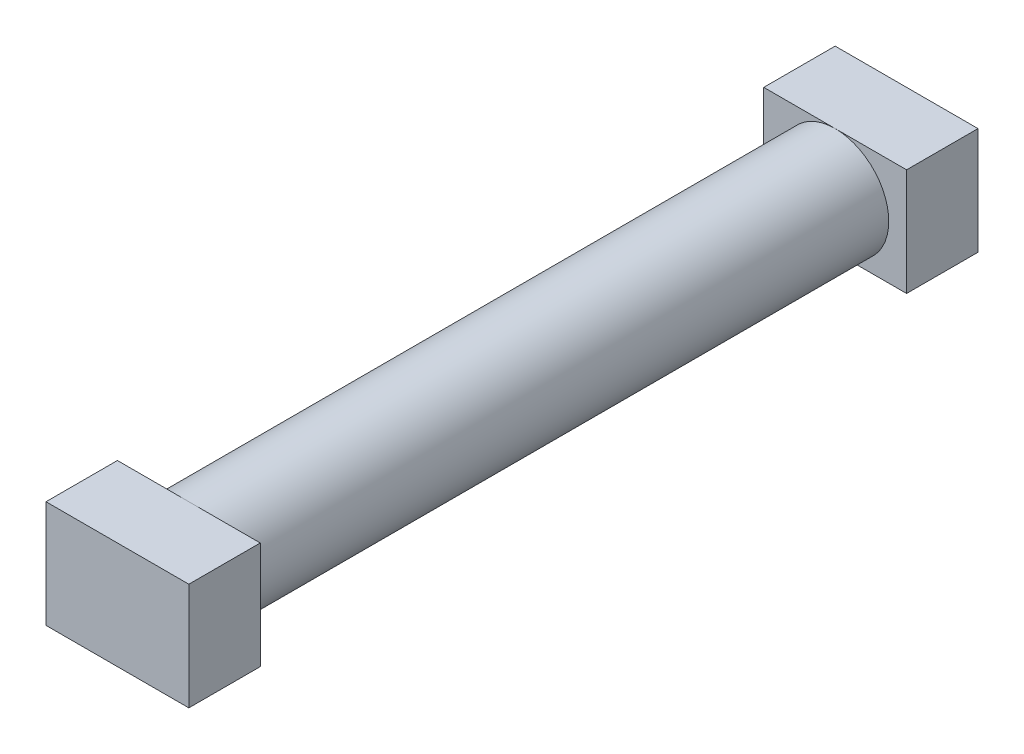
ISO-10303-21;
HEADER;
FILE_DESCRIPTION(('STEP AP214'),'2;1');
FILE_NAME('part.step','',(''),(''),'','','');
FILE_SCHEMA(('AUTOMOTIVE_DESIGN { 1 0 10303 214 1 1 1 1 }'));
ENDSEC;
DATA;
#1=APPLICATION_CONTEXT('core data for automotive mechanical design processes');
#2=APPLICATION_PROTOCOL_DEFINITION('international standard','automotive_design',2000,#1);
#3=PRODUCT_CONTEXT('',#1,'mechanical');
#4=PRODUCT('Part','Part','',(#3));
#5=PRODUCT_RELATED_PRODUCT_CATEGORY('part','',(#4));
#6=PRODUCT_DEFINITION_FORMATION('','',#4);
#7=PRODUCT_DEFINITION_CONTEXT('part definition',#1,'design');
#8=PRODUCT_DEFINITION('design','',#6,#7);
#9=PRODUCT_DEFINITION_SHAPE('','',#8);
#10=(LENGTH_UNIT() NAMED_UNIT(*) SI_UNIT(.MILLI.,.METRE.));
#11=(NAMED_UNIT(*) PLANE_ANGLE_UNIT() SI_UNIT($,.RADIAN.));
#12=(NAMED_UNIT(*) SI_UNIT($,.STERADIAN.) SOLID_ANGLE_UNIT());
#13=UNCERTAINTY_MEASURE_WITH_UNIT(LENGTH_MEASURE(1.E-05),#10,'distance_accuracy_value','');
#14=(GEOMETRIC_REPRESENTATION_CONTEXT(3) GLOBAL_UNCERTAINTY_ASSIGNED_CONTEXT((#13)) GLOBAL_UNIT_ASSIGNED_CONTEXT((#10,
#11,#12)) REPRESENTATION_CONTEXT('',''));
#15=CARTESIAN_POINT('',(0.,0.,0.));
#16=DIRECTION('',(0.,0.,1.));
#17=DIRECTION('',(1.,0.,0.));
#18=AXIS2_PLACEMENT_3D('',#15,#16,#17);
#19=CARTESIAN_POINT('',(0.,0.,9.05));
#20=DIRECTION('',(0.,0.,-1.));
#21=DIRECTION('',(-1.,0.,0.));
#22=AXIS2_PLACEMENT_3D('',#19,#20,#21);
#23=CYLINDRICAL_SURFACE('',#22,1.5);
#24=CARTESIAN_POINT('',(0.,0.,9.05));
#25=DIRECTION('',(0.,0.,1.));
#26=DIRECTION('',(1.,0.,0.));
#27=AXIS2_PLACEMENT_3D('',#24,#25,#26);
#28=CIRCLE('',#27,1.5);
#29=CARTESIAN_POINT('',(0.,1.5,9.05));
#30=VERTEX_POINT('',#29);
#31=CARTESIAN_POINT('',(0.,-1.5,9.05));
#32=VERTEX_POINT('',#31);
#33=EDGE_CURVE('E11',#30,#32,#28,.T.);
#34=ORIENTED_EDGE('',*,*,#33,.F.);
#35=EDGE_CURVE('E41',#32,#30,#28,.T.);
#36=ORIENTED_EDGE('',*,*,#35,.F.);
#37=EDGE_LOOP('',(#34,#36));
#38=FACE_BOUND('',#37,.T.);
#39=CARTESIAN_POINT('',(0.,0.,-9.05));
#40=DIRECTION('',(0.,0.,1.));
#41=DIRECTION('',(1.,0.,0.));
#42=AXIS2_PLACEMENT_3D('',#39,#40,#41);
#43=CIRCLE('',#42,1.5);
#44=CARTESIAN_POINT('',(0.,1.5,-9.05));
#45=VERTEX_POINT('',#44);
#46=CARTESIAN_POINT('',(0.,-1.5,-9.05));
#47=VERTEX_POINT('',#46);
#48=EDGE_CURVE('E36',#45,#47,#43,.T.);
#49=ORIENTED_EDGE('',*,*,#48,.T.);
#50=EDGE_CURVE('E172',#47,#45,#43,.T.);
#51=ORIENTED_EDGE('',*,*,#50,.T.);
#52=EDGE_LOOP('',(#49,#51));
#53=FACE_BOUND('',#52,.T.);
#54=ADVANCED_FACE('F33',(#38,#53),#23,.T.);
#55=CARTESIAN_POINT('',(0.,0.,9.05));
#56=DIRECTION('',(0.,0.,1.));
#57=DIRECTION('',(1.,0.,0.));
#58=AXIS2_PLACEMENT_3D('',#55,#56,#57);
#59=PLANE('',#58);
#60=DIRECTION('',(-1.,0.,0.));
#61=VECTOR('',#60,1.);
#62=CARTESIAN_POINT('',(-2.,1.5,9.05));
#63=LINE('',#62,#61);
#64=CARTESIAN_POINT('',(-2.,1.5,9.05));
#65=VERTEX_POINT('',#64);
#66=EDGE_CURVE('E159',#30,#65,#63,.T.);
#67=ORIENTED_EDGE('',*,*,#66,.F.);
#68=ORIENTED_EDGE('',*,*,#33,.T.);
#69=DIRECTION('',(1.,0.,0.));
#70=VECTOR('',#69,1.);
#71=CARTESIAN_POINT('',(-2.,-1.5,9.05));
#72=LINE('',#71,#70);
#73=CARTESIAN_POINT('',(-2.,-1.5,9.05));
#74=VERTEX_POINT('',#73);
#75=EDGE_CURVE('E154',#74,#32,#72,.T.);
#76=ORIENTED_EDGE('',*,*,#75,.F.);
#77=DIRECTION('',(0.,-1.,0.));
#78=VECTOR('',#77,1.);
#79=CARTESIAN_POINT('',(-2.,1.5,9.05));
#80=LINE('',#79,#78);
#81=EDGE_CURVE('E134',#65,#74,#80,.T.);
#82=ORIENTED_EDGE('',*,*,#81,.F.);
#83=EDGE_LOOP('',(#67,#68,#76,#82));
#84=FACE_BOUND('',#83,.T.);
#85=ADVANCED_FACE('F187',(#84),#59,.F.);
#86=CARTESIAN_POINT('',(2.,-1.5,9.05));
#87=VERTEX_POINT('',#86);
#88=EDGE_CURVE('E137',#32,#87,#72,.T.);
#89=ORIENTED_EDGE('',*,*,#88,.F.);
#90=ORIENTED_EDGE('',*,*,#35,.T.);
#91=CARTESIAN_POINT('',(2.,1.5,9.05));
#92=VERTEX_POINT('',#91);
#93=EDGE_CURVE('E147',#92,#30,#63,.T.);
#94=ORIENTED_EDGE('',*,*,#93,.F.);
#95=DIRECTION('',(0.,1.,0.));
#96=VECTOR('',#95,1.);
#97=CARTESIAN_POINT('',(2.,1.5,9.05));
#98=LINE('',#97,#96);
#99=EDGE_CURVE('E157',#87,#92,#98,.T.);
#100=ORIENTED_EDGE('',*,*,#99,.F.);
#101=EDGE_LOOP('',(#89,#90,#94,#100));
#102=FACE_BOUND('',#101,.T.);
#103=ADVANCED_FACE('F183',(#102),#59,.F.);
#104=CARTESIAN_POINT('',(-2.,1.5,11.05));
#105=DIRECTION('',(1.,0.,0.));
#106=DIRECTION('',(0.,1.,0.));
#107=AXIS2_PLACEMENT_3D('',#104,#105,#106);
#108=PLANE('',#107);
#109=ORIENTED_EDGE('',*,*,#81,.T.);
#110=DIRECTION('',(0.,0.,-1.));
#111=VECTOR('',#110,1.);
#112=CARTESIAN_POINT('',(-2.,-1.5,11.05));
#113=LINE('',#112,#111);
#114=CARTESIAN_POINT('',(-2.,-1.5,11.05));
#115=VERTEX_POINT('',#114);
#116=EDGE_CURVE('E170',#115,#74,#113,.T.);
#117=ORIENTED_EDGE('',*,*,#116,.F.);
#118=DIRECTION('',(0.,-1.,0.));
#119=VECTOR('',#118,1.);
#120=CARTESIAN_POINT('',(-2.,1.5,11.05));
#121=LINE('',#120,#119);
#122=CARTESIAN_POINT('',(-2.,1.5,11.05));
#123=VERTEX_POINT('',#122);
#124=EDGE_CURVE('E143',#123,#115,#121,.T.);
#125=ORIENTED_EDGE('',*,*,#124,.F.);
#126=DIRECTION('',(0.,0.,-1.));
#127=VECTOR('',#126,1.);
#128=CARTESIAN_POINT('',(-2.,1.5,11.05));
#129=LINE('',#128,#127);
#130=EDGE_CURVE('E152',#123,#65,#129,.T.);
#131=ORIENTED_EDGE('',*,*,#130,.T.);
#132=EDGE_LOOP('',(#109,#117,#125,#131));
#133=FACE_BOUND('',#132,.T.);
#134=ADVANCED_FACE('F202',(#133),#108,.F.);
#135=CARTESIAN_POINT('',(-2.,-1.5,11.05));
#136=DIRECTION('',(0.,1.,0.));
#137=DIRECTION('',(0.,0.,1.));
#138=AXIS2_PLACEMENT_3D('',#135,#136,#137);
#139=PLANE('',#138);
#140=ORIENTED_EDGE('',*,*,#75,.T.);
#141=ORIENTED_EDGE('',*,*,#88,.T.);
#142=DIRECTION('',(0.,0.,-1.));
#143=VECTOR('',#142,1.);
#144=CARTESIAN_POINT('',(2.,-1.5,11.05));
#145=LINE('',#144,#143);
#146=CARTESIAN_POINT('',(2.,-1.5,11.05));
#147=VERTEX_POINT('',#146);
#148=EDGE_CURVE('E167',#147,#87,#145,.T.);
#149=ORIENTED_EDGE('',*,*,#148,.F.);
#150=DIRECTION('',(1.,0.,0.));
#151=VECTOR('',#150,1.);
#152=CARTESIAN_POINT('',(-2.,-1.5,11.05));
#153=LINE('',#152,#151);
#154=EDGE_CURVE('E146',#115,#147,#153,.T.);
#155=ORIENTED_EDGE('',*,*,#154,.F.);
#156=ORIENTED_EDGE('',*,*,#116,.T.);
#157=EDGE_LOOP('',(#140,#141,#149,#155,#156));
#158=FACE_BOUND('',#157,.T.);
#159=ADVANCED_FACE('F197',(#158),#139,.F.);
#160=CARTESIAN_POINT('',(2.,1.5,11.05));
#161=DIRECTION('',(-1.,0.,0.));
#162=DIRECTION('',(0.,-1.,0.));
#163=AXIS2_PLACEMENT_3D('',#160,#161,#162);
#164=PLANE('',#163);
#165=ORIENTED_EDGE('',*,*,#99,.T.);
#166=DIRECTION('',(0.,0.,-1.));
#167=VECTOR('',#166,1.);
#168=CARTESIAN_POINT('',(2.,1.5,11.05));
#169=LINE('',#168,#167);
#170=CARTESIAN_POINT('',(2.,1.5,11.05));
#171=VERTEX_POINT('',#170);
#172=EDGE_CURVE('E164',#171,#92,#169,.T.);
#173=ORIENTED_EDGE('',*,*,#172,.F.);
#174=DIRECTION('',(0.,1.,0.));
#175=VECTOR('',#174,1.);
#176=CARTESIAN_POINT('',(2.,1.5,11.05));
#177=LINE('',#176,#175);
#178=EDGE_CURVE('E149',#147,#171,#177,.T.);
#179=ORIENTED_EDGE('',*,*,#178,.F.);
#180=ORIENTED_EDGE('',*,*,#148,.T.);
#181=EDGE_LOOP('',(#165,#173,#179,#180));
#182=FACE_BOUND('',#181,.T.);
#183=ADVANCED_FACE('F195',(#182),#164,.F.);
#184=CARTESIAN_POINT('',(-2.,1.5,11.05));
#185=DIRECTION('',(0.,-1.,0.));
#186=DIRECTION('',(0.,0.,-1.));
#187=AXIS2_PLACEMENT_3D('',#184,#185,#186);
#188=PLANE('',#187);
#189=ORIENTED_EDGE('',*,*,#93,.T.);
#190=ORIENTED_EDGE('',*,*,#66,.T.);
#191=ORIENTED_EDGE('',*,*,#130,.F.);
#192=DIRECTION('',(-1.,0.,0.));
#193=VECTOR('',#192,1.);
#194=CARTESIAN_POINT('',(-2.,1.5,11.05));
#195=LINE('',#194,#193);
#196=EDGE_CURVE('E151',#171,#123,#195,.T.);
#197=ORIENTED_EDGE('',*,*,#196,.F.);
#198=ORIENTED_EDGE('',*,*,#172,.T.);
#199=EDGE_LOOP('',(#189,#190,#191,#197,#198));
#200=FACE_BOUND('',#199,.T.);
#201=ADVANCED_FACE('F190',(#200),#188,.F.);
#202=CARTESIAN_POINT('',(0.,0.,11.05));
#203=DIRECTION('',(0.,0.,1.));
#204=DIRECTION('',(1.,0.,0.));
#205=AXIS2_PLACEMENT_3D('',#202,#203,#204);
#206=PLANE('',#205);
#207=ORIENTED_EDGE('',*,*,#124,.T.);
#208=ORIENTED_EDGE('',*,*,#154,.T.);
#209=ORIENTED_EDGE('',*,*,#178,.T.);
#210=ORIENTED_EDGE('',*,*,#196,.T.);
#211=EDGE_LOOP('',(#207,#208,#209,#210));
#212=FACE_BOUND('',#211,.T.);
#213=ADVANCED_FACE('F200',(#212),#206,.T.);
#214=CARTESIAN_POINT('',(0.,0.,-9.05));
#215=DIRECTION('',(0.,0.,-1.));
#216=DIRECTION('',(-1.,0.,0.));
#217=AXIS2_PLACEMENT_3D('',#214,#215,#216);
#218=PLANE('',#217);
#219=ORIENTED_EDGE('',*,*,#48,.F.);
#220=DIRECTION('',(1.,0.,0.));
#221=VECTOR('',#220,1.);
#222=CARTESIAN_POINT('',(2.,1.5,-9.05));
#223=LINE('',#222,#221);
#224=CARTESIAN_POINT('',(-2.,1.5,-9.05));
#225=VERTEX_POINT('',#224);
#226=EDGE_CURVE('E48',#225,#45,#223,.T.);
#227=ORIENTED_EDGE('',*,*,#226,.F.);
#228=DIRECTION('',(0.,1.,0.));
#229=VECTOR('',#228,1.);
#230=CARTESIAN_POINT('',(-2.,1.5,-9.05));
#231=LINE('',#230,#229);
#232=CARTESIAN_POINT('',(-2.,-1.5,-9.05));
#233=VERTEX_POINT('',#232);
#234=EDGE_CURVE('E331',#233,#225,#231,.T.);
#235=ORIENTED_EDGE('',*,*,#234,.F.);
#236=DIRECTION('',(-1.,0.,0.));
#237=VECTOR('',#236,1.);
#238=CARTESIAN_POINT('',(2.,-1.5,-9.05));
#239=LINE('',#238,#237);
#240=EDGE_CURVE('E330',#47,#233,#239,.T.);
#241=ORIENTED_EDGE('',*,*,#240,.F.);
#242=EDGE_LOOP('',(#219,#227,#235,#241));
#243=FACE_BOUND('',#242,.T.);
#244=ADVANCED_FACE('F236',(#243),#218,.F.);
#245=CARTESIAN_POINT('',(2.,1.5,-11.05));
#246=DIRECTION('',(-1.,0.,0.));
#247=DIRECTION('',(0.,0.,1.));
#248=AXIS2_PLACEMENT_3D('',#245,#246,#247);
#249=PLANE('',#248);
#250=DIRECTION('',(0.,-1.,0.));
#251=VECTOR('',#250,1.);
#252=CARTESIAN_POINT('',(2.,1.5,-9.05));
#253=LINE('',#252,#251);
#254=CARTESIAN_POINT('',(2.,1.5,-9.05));
#255=VERTEX_POINT('',#254);
#256=CARTESIAN_POINT('',(2.,-1.5,-9.05));
#257=VERTEX_POINT('',#256);
#258=EDGE_CURVE('E133',#255,#257,#253,.T.);
#259=ORIENTED_EDGE('',*,*,#258,.T.);
#260=DIRECTION('',(0.,0.,1.));
#261=VECTOR('',#260,1.);
#262=CARTESIAN_POINT('',(2.,-1.5,-11.05));
#263=LINE('',#262,#261);
#264=CARTESIAN_POINT('',(2.,-1.5,-11.05));
#265=VERTEX_POINT('',#264);
#266=EDGE_CURVE('E114',#265,#257,#263,.T.);
#267=ORIENTED_EDGE('',*,*,#266,.F.);
#268=DIRECTION('',(0.,-1.,0.));
#269=VECTOR('',#268,1.);
#270=CARTESIAN_POINT('',(2.,1.5,-11.05));
#271=LINE('',#270,#269);
#272=CARTESIAN_POINT('',(2.,1.5,-11.05));
#273=VERTEX_POINT('',#272);
#274=EDGE_CURVE('E121',#273,#265,#271,.T.);
#275=ORIENTED_EDGE('',*,*,#274,.F.);
#276=DIRECTION('',(0.,0.,1.));
#277=VECTOR('',#276,1.);
#278=CARTESIAN_POINT('',(2.,1.5,-11.05));
#279=LINE('',#278,#277);
#280=EDGE_CURVE('E338',#273,#255,#279,.T.);
#281=ORIENTED_EDGE('',*,*,#280,.T.);
#282=EDGE_LOOP('',(#259,#267,#275,#281));
#283=FACE_BOUND('',#282,.T.);
#284=ADVANCED_FACE('F131',(#283),#249,.F.);
#285=CARTESIAN_POINT('',(2.,-1.5,-11.05));
#286=DIRECTION('',(0.,1.,0.));
#287=DIRECTION('',(0.,0.,1.));
#288=AXIS2_PLACEMENT_3D('',#285,#286,#287);
#289=PLANE('',#288);
#290=EDGE_CURVE('E327',#257,#47,#239,.T.);
#291=ORIENTED_EDGE('',*,*,#290,.T.);
#292=ORIENTED_EDGE('',*,*,#240,.T.);
#293=DIRECTION('',(0.,0.,1.));
#294=VECTOR('',#293,1.);
#295=CARTESIAN_POINT('',(-2.,-1.5,-11.05));
#296=LINE('',#295,#294);
#297=CARTESIAN_POINT('',(-2.,-1.5,-11.05));
#298=VERTEX_POINT('',#297);
#299=EDGE_CURVE('E117',#298,#233,#296,.T.);
#300=ORIENTED_EDGE('',*,*,#299,.F.);
#301=DIRECTION('',(-1.,0.,0.));
#302=VECTOR('',#301,1.);
#303=CARTESIAN_POINT('',(2.,-1.5,-11.05));
#304=LINE('',#303,#302);
#305=EDGE_CURVE('E109',#265,#298,#304,.T.);
#306=ORIENTED_EDGE('',*,*,#305,.F.);
#307=ORIENTED_EDGE('',*,*,#266,.T.);
#308=EDGE_LOOP('',(#291,#292,#300,#306,#307));
#309=FACE_BOUND('',#308,.T.);
#310=ADVANCED_FACE('F112',(#309),#289,.F.);
#311=CARTESIAN_POINT('',(-2.,1.5,-11.05));
#312=DIRECTION('',(1.,0.,0.));
#313=DIRECTION('',(0.,0.,-1.));
#314=AXIS2_PLACEMENT_3D('',#311,#312,#313);
#315=PLANE('',#314);
#316=ORIENTED_EDGE('',*,*,#234,.T.);
#317=DIRECTION('',(0.,0.,1.));
#318=VECTOR('',#317,1.);
#319=CARTESIAN_POINT('',(-2.,1.5,-11.05));
#320=LINE('',#319,#318);
#321=CARTESIAN_POINT('',(-2.,1.5,-11.05));
#322=VERTEX_POINT('',#321);
#323=EDGE_CURVE('E139',#322,#225,#320,.T.);
#324=ORIENTED_EDGE('',*,*,#323,.F.);
#325=DIRECTION('',(0.,1.,0.));
#326=VECTOR('',#325,1.);
#327=CARTESIAN_POINT('',(-2.,1.5,-11.05));
#328=LINE('',#327,#326);
#329=EDGE_CURVE('E120',#298,#322,#328,.T.);
#330=ORIENTED_EDGE('',*,*,#329,.F.);
#331=ORIENTED_EDGE('',*,*,#299,.T.);
#332=EDGE_LOOP('',(#316,#324,#330,#331));
#333=FACE_BOUND('',#332,.T.);
#334=ADVANCED_FACE('F255',(#333),#315,.F.);
#335=CARTESIAN_POINT('',(2.,1.5,-11.05));
#336=DIRECTION('',(0.,-1.,0.));
#337=DIRECTION('',(0.,0.,-1.));
#338=AXIS2_PLACEMENT_3D('',#335,#336,#337);
#339=PLANE('',#338);
#340=ORIENTED_EDGE('',*,*,#226,.T.);
#341=EDGE_CURVE('E328',#45,#255,#223,.T.);
#342=ORIENTED_EDGE('',*,*,#341,.T.);
#343=ORIENTED_EDGE('',*,*,#280,.F.);
#344=DIRECTION('',(1.,0.,0.));
#345=VECTOR('',#344,1.);
#346=CARTESIAN_POINT('',(2.,1.5,-11.05));
#347=LINE('',#346,#345);
#348=EDGE_CURVE('E126',#322,#273,#347,.T.);
#349=ORIENTED_EDGE('',*,*,#348,.F.);
#350=ORIENTED_EDGE('',*,*,#323,.T.);
#351=EDGE_LOOP('',(#340,#342,#343,#349,#350));
#352=FACE_BOUND('',#351,.T.);
#353=ADVANCED_FACE('F262',(#352),#339,.F.);
#354=CARTESIAN_POINT('',(0.,0.,-11.05));
#355=DIRECTION('',(0.,0.,-1.));
#356=DIRECTION('',(-1.,0.,0.));
#357=AXIS2_PLACEMENT_3D('',#354,#355,#356);
#358=PLANE('',#357);
#359=ORIENTED_EDGE('',*,*,#274,.T.);
#360=ORIENTED_EDGE('',*,*,#305,.T.);
#361=ORIENTED_EDGE('',*,*,#329,.T.);
#362=ORIENTED_EDGE('',*,*,#348,.T.);
#363=EDGE_LOOP('',(#359,#360,#361,#362));
#364=FACE_BOUND('',#363,.T.);
#365=ADVANCED_FACE('F124',(#364),#358,.T.);
#366=ORIENTED_EDGE('',*,*,#50,.F.);
#367=ORIENTED_EDGE('',*,*,#290,.F.);
#368=ORIENTED_EDGE('',*,*,#258,.F.);
#369=ORIENTED_EDGE('',*,*,#341,.F.);
#370=EDGE_LOOP('',(#366,#367,#368,#369));
#371=FACE_BOUND('',#370,.T.);
#372=ADVANCED_FACE('F244',(#371),#218,.F.);
#373=CLOSED_SHELL('',(#54,#85,#103,#134,#159,#183,#201,#213,#244,#284,#310,#334,#353,#365,#372));
#374=MANIFOLD_SOLID_BREP('B2',#373);
#375=ADVANCED_BREP_SHAPE_REPRESENTATION('',(#18,#374),#14);
#376=SHAPE_DEFINITION_REPRESENTATION(#9,#375);
ENDSEC;
END-ISO-10303-21;
